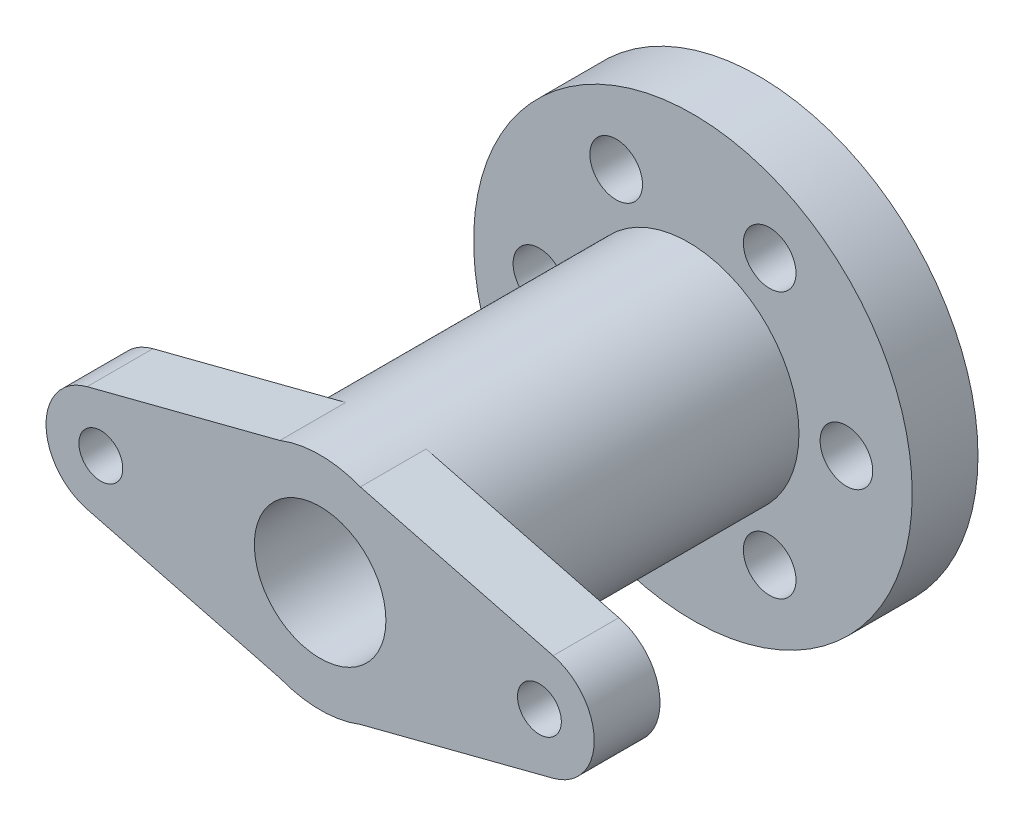
ISO-10303-21;
HEADER;
FILE_DESCRIPTION(('STEP AP214'),'2;1');
FILE_NAME('part.step','',(''),(''),'','','');
FILE_SCHEMA(('AUTOMOTIVE_DESIGN { 1 0 10303 214 1 1 1 1 }'));
ENDSEC;
DATA;
#1=APPLICATION_CONTEXT('core data for automotive mechanical design processes');
#2=APPLICATION_PROTOCOL_DEFINITION('international standard','automotive_design',2000,#1);
#3=PRODUCT_CONTEXT('',#1,'mechanical');
#4=PRODUCT('Part','Part','',(#3));
#5=PRODUCT_RELATED_PRODUCT_CATEGORY('part','',(#4));
#6=PRODUCT_DEFINITION_FORMATION('','',#4);
#7=PRODUCT_DEFINITION_CONTEXT('part definition',#1,'design');
#8=PRODUCT_DEFINITION('design','',#6,#7);
#9=PRODUCT_DEFINITION_SHAPE('','',#8);
#10=(LENGTH_UNIT() NAMED_UNIT(*) SI_UNIT(.MILLI.,.METRE.));
#11=(NAMED_UNIT(*) PLANE_ANGLE_UNIT() SI_UNIT($,.RADIAN.));
#12=(NAMED_UNIT(*) SI_UNIT($,.STERADIAN.) SOLID_ANGLE_UNIT());
#13=UNCERTAINTY_MEASURE_WITH_UNIT(LENGTH_MEASURE(1.E-05),#10,'distance_accuracy_value','');
#14=(GEOMETRIC_REPRESENTATION_CONTEXT(3) GLOBAL_UNCERTAINTY_ASSIGNED_CONTEXT((#13)) GLOBAL_UNIT_ASSIGNED_CONTEXT((#10,
#11,#12)) REPRESENTATION_CONTEXT('',''));
#15=CARTESIAN_POINT('',(0.,0.,0.));
#16=DIRECTION('',(0.,0.,1.));
#17=DIRECTION('',(1.,0.,0.));
#18=AXIS2_PLACEMENT_3D('',#15,#16,#17);
#19=CARTESIAN_POINT('',(0.,0.,16.));
#20=DIRECTION('',(0.,0.,1.));
#21=DIRECTION('',(1.,0.,0.));
#22=AXIS2_PLACEMENT_3D('',#19,#20,#21);
#23=CYLINDRICAL_SURFACE('',#22,25.1818936432499);
#24=CARTESIAN_POINT('',(0.,0.,16.));
#25=DIRECTION('',(0.,0.,1.));
#26=DIRECTION('',(1.,0.,0.));
#27=AXIS2_PLACEMENT_3D('',#24,#25,#26);
#28=CIRCLE('',#27,25.1818936432499);
#29=CARTESIAN_POINT('',(25.1818936432499,0.,16.));
#30=VERTEX_POINT('',#29);
#31=EDGE_CURVE('E243',#30,#30,#28,.T.);
#32=ORIENTED_EDGE('',*,*,#31,.T.);
#33=EDGE_LOOP('',(#32));
#34=FACE_BOUND('',#33,.T.);
#35=CARTESIAN_POINT('',(0.,0.,85.));
#36=DIRECTION('',(0.,0.,1.));
#37=DIRECTION('',(1.,0.,0.));
#38=AXIS2_PLACEMENT_3D('',#35,#36,#37);
#39=CIRCLE('',#38,25.1818936432499);
#40=CARTESIAN_POINT('',(9.17528323307377,23.4508410308207,85.));
#41=VERTEX_POINT('',#40);
#42=CARTESIAN_POINT('',(9.17528323307378,-23.4508410308207,85.));
#43=VERTEX_POINT('',#42);
#44=EDGE_CURVE('E246',#41,#43,#39,.F.);
#45=ORIENTED_EDGE('',*,*,#44,.T.);
#46=DIRECTION('',(0.,0.,1.));
#47=VECTOR('',#46,1.);
#48=CARTESIAN_POINT('',(9.17528323307378,-23.4508410308207,16.));
#49=LINE('',#48,#47);
#50=CARTESIAN_POINT('',(9.17528323307381,-23.4508410308207,100.));
#51=VERTEX_POINT('',#50);
#52=EDGE_CURVE('E197',#43,#51,#49,.T.);
#53=ORIENTED_EDGE('',*,*,#52,.T.);
#54=CARTESIAN_POINT('',(0.,0.,100.));
#55=DIRECTION('',(0.,0.,1.));
#56=DIRECTION('',(1.,0.,0.));
#57=AXIS2_PLACEMENT_3D('',#54,#55,#56);
#58=CIRCLE('',#57,25.1818936432499);
#59=CARTESIAN_POINT('',(-9.1752832330737,-23.4508410308208,100.));
#60=VERTEX_POINT('',#59);
#61=EDGE_CURVE('E127',#60,#51,#58,.T.);
#62=ORIENTED_EDGE('',*,*,#61,.F.);
#63=DIRECTION('',(0.,0.,1.));
#64=VECTOR('',#63,1.);
#65=CARTESIAN_POINT('',(-9.17528323307373,-23.4508410308207,16.));
#66=LINE('',#65,#64);
#67=CARTESIAN_POINT('',(-9.17528323307372,-23.4508410308207,85.));
#68=VERTEX_POINT('',#67);
#69=EDGE_CURVE('E238',#60,#68,#66,.F.);
#70=ORIENTED_EDGE('',*,*,#69,.T.);
#71=CARTESIAN_POINT('',(-9.17528323307363,23.4508410308208,85.));
#72=VERTEX_POINT('',#71);
#73=EDGE_CURVE('E194',#68,#72,#39,.F.);
#74=ORIENTED_EDGE('',*,*,#73,.T.);
#75=DIRECTION('',(0.,0.,1.));
#76=VECTOR('',#75,1.);
#77=CARTESIAN_POINT('',(-9.17528323307364,23.4508410308208,16.));
#78=LINE('',#77,#76);
#79=CARTESIAN_POINT('',(-9.17528323307373,23.4508410308207,100.));
#80=VERTEX_POINT('',#79);
#81=EDGE_CURVE('E187',#72,#80,#78,.T.);
#82=ORIENTED_EDGE('',*,*,#81,.T.);
#83=CARTESIAN_POINT('',(9.17528323307377,23.4508410308207,100.));
#84=VERTEX_POINT('',#83);
#85=EDGE_CURVE('E179',#84,#80,#58,.T.);
#86=ORIENTED_EDGE('',*,*,#85,.F.);
#87=DIRECTION('',(0.,0.,1.));
#88=VECTOR('',#87,1.);
#89=CARTESIAN_POINT('',(9.17528323307377,23.4508410308207,16.));
#90=LINE('',#89,#88);
#91=EDGE_CURVE('E180',#84,#41,#90,.F.);
#92=ORIENTED_EDGE('',*,*,#91,.T.);
#93=EDGE_LOOP('',(#45,#53,#62,#70,#74,#82,#86,#92));
#94=FACE_BOUND('',#93,.T.);
#95=ADVANCED_FACE('F55',(#34,#94),#23,.T.);
#96=CARTESIAN_POINT('',(0.,0.,16.));
#97=DIRECTION('',(0.,0.,1.));
#98=DIRECTION('',(1.,0.,0.));
#99=AXIS2_PLACEMENT_3D('',#96,#97,#98);
#100=PLANE('',#99);
#101=CARTESIAN_POINT('',(0.,0.,16.));
#102=DIRECTION('',(0.,0.,1.));
#103=DIRECTION('',(1.,0.,0.));
#104=AXIS2_PLACEMENT_3D('',#101,#102,#103);
#105=CIRCLE('',#104,15.);
#106=CARTESIAN_POINT('',(15.,0.,16.));
#107=VERTEX_POINT('',#106);
#108=EDGE_CURVE('E176',#107,#107,#105,.T.);
#109=ORIENTED_EDGE('',*,*,#108,.T.);
#110=EDGE_LOOP('',(#109));
#111=FACE_BOUND('',#110,.T.);
#112=ORIENTED_EDGE('',*,*,#31,.F.);
#113=EDGE_LOOP('',(#112));
#114=FACE_BOUND('',#113,.T.);
#115=ADVANCED_FACE('F271',(#111,#114),#100,.F.);
#116=CARTESIAN_POINT('',(0.,0.,100.));
#117=DIRECTION('',(0.,0.,1.));
#118=DIRECTION('',(1.,0.,0.));
#119=AXIS2_PLACEMENT_3D('',#116,#117,#118);
#120=PLANE('',#119);
#121=CARTESIAN_POINT('',(0.,0.,100.));
#122=DIRECTION('',(0.,0.,1.));
#123=DIRECTION('',(1.,0.,0.));
#124=AXIS2_PLACEMENT_3D('',#121,#122,#123);
#125=CIRCLE('',#124,15.);
#126=CARTESIAN_POINT('',(15.,0.,100.));
#127=VERTEX_POINT('',#126);
#128=EDGE_CURVE('E12',#127,#127,#125,.T.);
#129=ORIENTED_EDGE('',*,*,#128,.F.);
#130=EDGE_LOOP('',(#129));
#131=FACE_BOUND('',#130,.T.);
#132=ORIENTED_EDGE('',*,*,#85,.T.);
#133=DIRECTION('',(-0.968245836551854,-0.25,0.));
#134=VECTOR('',#133,1.);
#135=CARTESIAN_POINT('',(-53.125,12.1030729568982,100.));
#136=LINE('',#135,#134);
#137=CARTESIAN_POINT('',(-53.125,12.1030729568982,100.));
#138=VERTEX_POINT('',#137);
#139=EDGE_CURVE('E160',#80,#138,#136,.T.);
#140=ORIENTED_EDGE('',*,*,#139,.T.);
#141=CARTESIAN_POINT('',(-50.,0.,100.));
#142=DIRECTION('',(0.,0.,1.));
#143=DIRECTION('',(1.,0.,0.));
#144=AXIS2_PLACEMENT_3D('',#141,#142,#143);
#145=CIRCLE('',#144,12.5);
#146=CARTESIAN_POINT('',(-53.125,-12.1030729568982,100.));
#147=VERTEX_POINT('',#146);
#148=EDGE_CURVE('E156',#138,#147,#145,.T.);
#149=ORIENTED_EDGE('',*,*,#148,.T.);
#150=DIRECTION('',(0.968245836551854,-0.25,0.));
#151=VECTOR('',#150,1.);
#152=CARTESIAN_POINT('',(-53.125,-12.1030729568982,100.));
#153=LINE('',#152,#151);
#154=EDGE_CURVE('E153',#147,#60,#153,.T.);
#155=ORIENTED_EDGE('',*,*,#154,.T.);
#156=ORIENTED_EDGE('',*,*,#61,.T.);
#157=DIRECTION('',(0.968245836551854,0.25,0.));
#158=VECTOR('',#157,1.);
#159=CARTESIAN_POINT('',(6.24999999999997,-24.2061459137964,100.));
#160=LINE('',#159,#158);
#161=CARTESIAN_POINT('',(53.125,-12.1030729568982,100.));
#162=VERTEX_POINT('',#161);
#163=EDGE_CURVE('E116',#51,#162,#160,.T.);
#164=ORIENTED_EDGE('',*,*,#163,.T.);
#165=CARTESIAN_POINT('',(50.,0.,100.));
#166=DIRECTION('',(0.,0.,1.));
#167=DIRECTION('',(1.,0.,0.));
#168=AXIS2_PLACEMENT_3D('',#165,#166,#167);
#169=CIRCLE('',#168,12.5);
#170=CARTESIAN_POINT('',(53.125,12.1030729568982,100.));
#171=VERTEX_POINT('',#170);
#172=EDGE_CURVE('E123',#162,#171,#169,.T.);
#173=ORIENTED_EDGE('',*,*,#172,.T.);
#174=DIRECTION('',(-0.968245836551854,0.25,0.));
#175=VECTOR('',#174,1.);
#176=CARTESIAN_POINT('',(6.24999999999997,24.2061459137964,100.));
#177=LINE('',#176,#175);
#178=EDGE_CURVE('E146',#171,#84,#177,.T.);
#179=ORIENTED_EDGE('',*,*,#178,.T.);
#180=EDGE_LOOP('',(#132,#140,#149,#155,#156,#164,#173,#179));
#181=FACE_BOUND('',#180,.T.);
#182=CARTESIAN_POINT('',(50.,0.,100.));
#183=DIRECTION('',(0.,0.,1.));
#184=DIRECTION('',(1.,0.,0.));
#185=AXIS2_PLACEMENT_3D('',#182,#183,#184);
#186=CIRCLE('',#185,5.);
#187=CARTESIAN_POINT('',(55.,0.,100.));
#188=VERTEX_POINT('',#187);
#189=EDGE_CURVE('E65',#188,#188,#186,.T.);
#190=ORIENTED_EDGE('',*,*,#189,.F.);
#191=EDGE_LOOP('',(#190));
#192=FACE_BOUND('',#191,.T.);
#193=CARTESIAN_POINT('',(-50.,0.,100.));
#194=DIRECTION('',(0.,0.,1.));
#195=DIRECTION('',(1.,0.,0.));
#196=AXIS2_PLACEMENT_3D('',#193,#194,#195);
#197=CIRCLE('',#196,5.);
#198=CARTESIAN_POINT('',(-45.,0.,100.));
#199=VERTEX_POINT('',#198);
#200=EDGE_CURVE('E149',#199,#199,#197,.T.);
#201=ORIENTED_EDGE('',*,*,#200,.F.);
#202=EDGE_LOOP('',(#201));
#203=FACE_BOUND('',#202,.T.);
#204=ADVANCED_FACE('F119',(#131,#181,#192,#203),#120,.T.);
#205=CARTESIAN_POINT('',(-50.,0.,100.));
#206=DIRECTION('',(0.,0.,-1.));
#207=DIRECTION('',(-1.,0.,0.));
#208=AXIS2_PLACEMENT_3D('',#205,#206,#207);
#209=CYLINDRICAL_SURFACE('',#208,5.);
#210=ORIENTED_EDGE('',*,*,#200,.T.);
#211=EDGE_LOOP('',(#210));
#212=FACE_BOUND('',#211,.T.);
#213=CARTESIAN_POINT('',(-50.,0.,85.));
#214=DIRECTION('',(0.,0.,1.));
#215=DIRECTION('',(1.,0.,0.));
#216=AXIS2_PLACEMENT_3D('',#213,#214,#215);
#217=CIRCLE('',#216,5.);
#218=CARTESIAN_POINT('',(-45.,0.,85.));
#219=VERTEX_POINT('',#218);
#220=EDGE_CURVE('E161',#219,#219,#217,.T.);
#221=ORIENTED_EDGE('',*,*,#220,.F.);
#222=EDGE_LOOP('',(#221));
#223=FACE_BOUND('',#222,.T.);
#224=ADVANCED_FACE('F262',(#212,#223),#209,.F.);
#225=CARTESIAN_POINT('',(-53.125,12.1030729568982,100.));
#226=DIRECTION('',(0.25,-0.968245836551854,0.));
#227=DIRECTION('',(0.968245836551854,0.25,0.));
#228=AXIS2_PLACEMENT_3D('',#225,#226,#227);
#229=PLANE('',#228);
#230=ORIENTED_EDGE('',*,*,#81,.F.);
#231=DIRECTION('',(-0.968245836551854,-0.25,0.));
#232=VECTOR('',#231,1.);
#233=CARTESIAN_POINT('',(-53.125,12.1030729568982,85.));
#234=LINE('',#233,#232);
#235=CARTESIAN_POINT('',(-53.125,12.1030729568982,85.));
#236=VERTEX_POINT('',#235);
#237=EDGE_CURVE('E170',#72,#236,#234,.T.);
#238=ORIENTED_EDGE('',*,*,#237,.T.);
#239=DIRECTION('',(0.,0.,-1.));
#240=VECTOR('',#239,1.);
#241=CARTESIAN_POINT('',(-53.125,12.1030729568982,100.));
#242=LINE('',#241,#240);
#243=EDGE_CURVE('E166',#138,#236,#242,.T.);
#244=ORIENTED_EDGE('',*,*,#243,.F.);
#245=ORIENTED_EDGE('',*,*,#139,.F.);
#246=EDGE_LOOP('',(#230,#238,#244,#245));
#247=FACE_BOUND('',#246,.T.);
#248=ADVANCED_FACE('F229',(#247),#229,.F.);
#249=CARTESIAN_POINT('',(-53.125,-12.1030729568982,100.));
#250=DIRECTION('',(0.25,0.968245836551854,0.));
#251=DIRECTION('',(-0.968245836551854,0.25,0.));
#252=AXIS2_PLACEMENT_3D('',#249,#250,#251);
#253=PLANE('',#252);
#254=ORIENTED_EDGE('',*,*,#69,.F.);
#255=ORIENTED_EDGE('',*,*,#154,.F.);
#256=DIRECTION('',(0.,0.,-1.));
#257=VECTOR('',#256,1.);
#258=CARTESIAN_POINT('',(-53.125,-12.1030729568982,100.));
#259=LINE('',#258,#257);
#260=CARTESIAN_POINT('',(-53.125,-12.1030729568982,85.));
#261=VERTEX_POINT('',#260);
#262=EDGE_CURVE('E200',#147,#261,#259,.T.);
#263=ORIENTED_EDGE('',*,*,#262,.T.);
#264=DIRECTION('',(0.968245836551854,-0.25,0.));
#265=VECTOR('',#264,1.);
#266=CARTESIAN_POINT('',(-53.125,-12.1030729568982,85.));
#267=LINE('',#266,#265);
#268=EDGE_CURVE('E203',#261,#68,#267,.T.);
#269=ORIENTED_EDGE('',*,*,#268,.T.);
#270=EDGE_LOOP('',(#254,#255,#263,#269));
#271=FACE_BOUND('',#270,.T.);
#272=ADVANCED_FACE('F236',(#271),#253,.F.);
#273=CARTESIAN_POINT('',(-50.,0.,100.));
#274=DIRECTION('',(0.,0.,-1.));
#275=DIRECTION('',(-1.,0.,0.));
#276=AXIS2_PLACEMENT_3D('',#273,#274,#275);
#277=CYLINDRICAL_SURFACE('',#276,12.5);
#278=CARTESIAN_POINT('',(-50.,0.,85.));
#279=DIRECTION('',(0.,0.,1.));
#280=DIRECTION('',(1.,0.,0.));
#281=AXIS2_PLACEMENT_3D('',#278,#279,#280);
#282=CIRCLE('',#281,12.5);
#283=EDGE_CURVE('E210',#236,#261,#282,.T.);
#284=ORIENTED_EDGE('',*,*,#283,.T.);
#285=ORIENTED_EDGE('',*,*,#262,.F.);
#286=ORIENTED_EDGE('',*,*,#148,.F.);
#287=ORIENTED_EDGE('',*,*,#243,.T.);
#288=EDGE_LOOP('',(#284,#285,#286,#287));
#289=FACE_BOUND('',#288,.T.);
#290=ADVANCED_FACE('F233',(#289),#277,.T.);
#291=CARTESIAN_POINT('',(-50.,0.,85.));
#292=DIRECTION('',(0.,0.,1.));
#293=DIRECTION('',(1.,0.,0.));
#294=AXIS2_PLACEMENT_3D('',#291,#292,#293);
#295=PLANE('',#294);
#296=ORIENTED_EDGE('',*,*,#73,.F.);
#297=ORIENTED_EDGE('',*,*,#268,.F.);
#298=ORIENTED_EDGE('',*,*,#283,.F.);
#299=ORIENTED_EDGE('',*,*,#237,.F.);
#300=EDGE_LOOP('',(#296,#297,#298,#299));
#301=FACE_BOUND('',#300,.T.);
#302=ORIENTED_EDGE('',*,*,#220,.T.);
#303=EDGE_LOOP('',(#302));
#304=FACE_BOUND('',#303,.T.);
#305=ADVANCED_FACE('F256',(#301,#304),#295,.F.);
#306=ORIENTED_EDGE('',*,*,#44,.F.);
#307=DIRECTION('',(-0.968245836551854,0.25,0.));
#308=VECTOR('',#307,1.);
#309=CARTESIAN_POINT('',(6.24999999999997,24.2061459137964,85.));
#310=LINE('',#309,#308);
#311=CARTESIAN_POINT('',(53.125,12.1030729568982,85.));
#312=VERTEX_POINT('',#311);
#313=EDGE_CURVE('E73',#312,#41,#310,.T.);
#314=ORIENTED_EDGE('',*,*,#313,.F.);
#315=CARTESIAN_POINT('',(50.,0.,85.));
#316=DIRECTION('',(0.,0.,1.));
#317=DIRECTION('',(1.,0.,0.));
#318=AXIS2_PLACEMENT_3D('',#315,#316,#317);
#319=CIRCLE('',#318,12.5);
#320=CARTESIAN_POINT('',(53.125,-12.1030729568982,85.));
#321=VERTEX_POINT('',#320);
#322=EDGE_CURVE('E141',#321,#312,#319,.T.);
#323=ORIENTED_EDGE('',*,*,#322,.F.);
#324=DIRECTION('',(0.968245836551854,0.25,0.));
#325=VECTOR('',#324,1.);
#326=CARTESIAN_POINT('',(6.24999999999997,-24.2061459137964,85.));
#327=LINE('',#326,#325);
#328=EDGE_CURVE('E136',#43,#321,#327,.T.);
#329=ORIENTED_EDGE('',*,*,#328,.F.);
#330=EDGE_LOOP('',(#306,#314,#323,#329));
#331=FACE_BOUND('',#330,.T.);
#332=CARTESIAN_POINT('',(50.,0.,85.));
#333=DIRECTION('',(0.,0.,1.));
#334=DIRECTION('',(1.,0.,0.));
#335=AXIS2_PLACEMENT_3D('',#332,#333,#334);
#336=CIRCLE('',#335,5.);
#337=CARTESIAN_POINT('',(55.,0.,85.));
#338=VERTEX_POINT('',#337);
#339=EDGE_CURVE('E165',#338,#338,#336,.T.);
#340=ORIENTED_EDGE('',*,*,#339,.T.);
#341=EDGE_LOOP('',(#340));
#342=FACE_BOUND('',#341,.T.);
#343=ADVANCED_FACE('F252',(#331,#342),#295,.F.);
#344=CARTESIAN_POINT('',(6.24999999999997,-24.2061459137964,100.));
#345=DIRECTION('',(-0.25,0.968245836551854,0.));
#346=DIRECTION('',(-0.968245836551854,-0.25,0.));
#347=AXIS2_PLACEMENT_3D('',#344,#345,#346);
#348=PLANE('',#347);
#349=ORIENTED_EDGE('',*,*,#52,.F.);
#350=ORIENTED_EDGE('',*,*,#328,.T.);
#351=DIRECTION('',(0.,0.,-1.));
#352=VECTOR('',#351,1.);
#353=CARTESIAN_POINT('',(53.125,-12.1030729568982,100.));
#354=LINE('',#353,#352);
#355=EDGE_CURVE('E133',#162,#321,#354,.T.);
#356=ORIENTED_EDGE('',*,*,#355,.F.);
#357=ORIENTED_EDGE('',*,*,#163,.F.);
#358=EDGE_LOOP('',(#349,#350,#356,#357));
#359=FACE_BOUND('',#358,.T.);
#360=ADVANCED_FACE('F134',(#359),#348,.F.);
#361=CARTESIAN_POINT('',(50.,0.,100.));
#362=DIRECTION('',(0.,0.,-1.));
#363=DIRECTION('',(-1.,0.,0.));
#364=AXIS2_PLACEMENT_3D('',#361,#362,#363);
#365=CYLINDRICAL_SURFACE('',#364,12.5);
#366=ORIENTED_EDGE('',*,*,#322,.T.);
#367=DIRECTION('',(0.,0.,-1.));
#368=VECTOR('',#367,1.);
#369=CARTESIAN_POINT('',(53.125,12.1030729568982,100.));
#370=LINE('',#369,#368);
#371=EDGE_CURVE('E140',#171,#312,#370,.T.);
#372=ORIENTED_EDGE('',*,*,#371,.F.);
#373=ORIENTED_EDGE('',*,*,#172,.F.);
#374=ORIENTED_EDGE('',*,*,#355,.T.);
#375=EDGE_LOOP('',(#366,#372,#373,#374));
#376=FACE_BOUND('',#375,.T.);
#377=ADVANCED_FACE('F143',(#376),#365,.T.);
#378=CARTESIAN_POINT('',(6.24999999999997,24.2061459137964,100.));
#379=DIRECTION('',(-0.25,-0.968245836551854,0.));
#380=DIRECTION('',(0.968245836551854,-0.25,0.));
#381=AXIS2_PLACEMENT_3D('',#378,#379,#380);
#382=PLANE('',#381);
#383=ORIENTED_EDGE('',*,*,#91,.F.);
#384=ORIENTED_EDGE('',*,*,#178,.F.);
#385=ORIENTED_EDGE('',*,*,#371,.T.);
#386=ORIENTED_EDGE('',*,*,#313,.T.);
#387=EDGE_LOOP('',(#383,#384,#385,#386));
#388=FACE_BOUND('',#387,.T.);
#389=ADVANCED_FACE('F254',(#388),#382,.F.);
#390=CARTESIAN_POINT('',(50.,0.,100.));
#391=DIRECTION('',(0.,0.,-1.));
#392=DIRECTION('',(-1.,0.,0.));
#393=AXIS2_PLACEMENT_3D('',#390,#391,#392);
#394=CYLINDRICAL_SURFACE('',#393,5.);
#395=ORIENTED_EDGE('',*,*,#189,.T.);
#396=EDGE_LOOP('',(#395));
#397=FACE_BOUND('',#396,.T.);
#398=ORIENTED_EDGE('',*,*,#339,.F.);
#399=EDGE_LOOP('',(#398));
#400=FACE_BOUND('',#399,.T.);
#401=ADVANCED_FACE('F291',(#397,#400),#394,.F.);
#402=CARTESIAN_POINT('',(0.,0.,-20.));
#403=DIRECTION('',(0.,0.,1.));
#404=DIRECTION('',(1.,0.,0.));
#405=AXIS2_PLACEMENT_3D('',#402,#403,#404);
#406=CYLINDRICAL_SURFACE('',#405,15.);
#407=ORIENTED_EDGE('',*,*,#128,.T.);
#408=EDGE_LOOP('',(#407));
#409=FACE_BOUND('',#408,.T.);
#410=ORIENTED_EDGE('',*,*,#108,.F.);
#411=EDGE_LOOP('',(#410));
#412=FACE_BOUND('',#411,.T.);
#413=ADVANCED_FACE('F57',(#409,#412),#406,.F.);
#414=CLOSED_SHELL('',(#95,#115,#204,#224,#248,#272,#290,#305,#343,#360,#377,#389,#401,#413));
#415=MANIFOLD_SOLID_BREP('B2',#414);
#416=CARTESIAN_POINT('',(0.,0.,15.));
#417=DIRECTION('',(0.,0.,-1.));
#418=DIRECTION('',(-1.,0.,0.));
#419=AXIS2_PLACEMENT_3D('',#416,#417,#418);
#420=CYLINDRICAL_SURFACE('',#419,50.);
#421=CARTESIAN_POINT('',(0.,0.,15.));
#422=DIRECTION('',(0.,0.,1.));
#423=DIRECTION('',(1.,0.,0.));
#424=AXIS2_PLACEMENT_3D('',#421,#422,#423);
#425=CIRCLE('',#424,50.);
#426=CARTESIAN_POINT('',(50.,0.,15.));
#427=VERTEX_POINT('',#426);
#428=EDGE_CURVE('E54',#427,#427,#425,.T.);
#429=ORIENTED_EDGE('',*,*,#428,.F.);
#430=EDGE_LOOP('',(#429));
#431=FACE_BOUND('',#430,.T.);
#432=CARTESIAN_POINT('',(0.,0.,0.));
#433=DIRECTION('',(0.,0.,1.));
#434=DIRECTION('',(1.,0.,0.));
#435=AXIS2_PLACEMENT_3D('',#432,#433,#434);
#436=CIRCLE('',#435,50.);
#437=CARTESIAN_POINT('',(50.,0.,0.));
#438=VERTEX_POINT('',#437);
#439=EDGE_CURVE('E424',#438,#438,#436,.T.);
#440=ORIENTED_EDGE('',*,*,#439,.T.);
#441=EDGE_LOOP('',(#440));
#442=FACE_BOUND('',#441,.T.);
#443=ADVANCED_FACE('F420',(#431,#442),#420,.T.);
#444=CARTESIAN_POINT('',(17.4999999999997,-30.3108891324555,15.));
#445=DIRECTION('',(0.,0.,-1.));
#446=DIRECTION('',(-1.,0.,0.));
#447=AXIS2_PLACEMENT_3D('',#444,#445,#446);
#448=CYLINDRICAL_SURFACE('',#447,6.);
#449=CARTESIAN_POINT('',(17.4999999999997,-30.3108891324555,15.));
#450=DIRECTION('',(0.,0.,1.));
#451=DIRECTION('',(1.,0.,0.));
#452=AXIS2_PLACEMENT_3D('',#449,#450,#451);
#453=CIRCLE('',#452,6.);
#454=CARTESIAN_POINT('',(23.4999999999997,-30.3108891324555,15.));
#455=VERTEX_POINT('',#454);
#456=EDGE_CURVE('E428',#455,#455,#453,.T.);
#457=ORIENTED_EDGE('',*,*,#456,.T.);
#458=EDGE_LOOP('',(#457));
#459=FACE_BOUND('',#458,.T.);
#460=CARTESIAN_POINT('',(17.4999999999997,-30.3108891324555,0.));
#461=DIRECTION('',(0.,0.,1.));
#462=DIRECTION('',(1.,0.,0.));
#463=AXIS2_PLACEMENT_3D('',#460,#461,#462);
#464=CIRCLE('',#463,6.);
#465=CARTESIAN_POINT('',(23.4999999999997,-30.3108891324555,0.));
#466=VERTEX_POINT('',#465);
#467=EDGE_CURVE('E452',#466,#466,#464,.T.);
#468=ORIENTED_EDGE('',*,*,#467,.F.);
#469=EDGE_LOOP('',(#468));
#470=FACE_BOUND('',#469,.T.);
#471=ADVANCED_FACE('F507',(#459,#470),#448,.F.);
#472=CARTESIAN_POINT('',(35.,-2.44403693719019E-13,15.));
#473=DIRECTION('',(0.,0.,-1.));
#474=DIRECTION('',(-1.,0.,0.));
#475=AXIS2_PLACEMENT_3D('',#472,#473,#474);
#476=CYLINDRICAL_SURFACE('',#475,6.);
#477=CARTESIAN_POINT('',(35.,-2.44403693719019E-13,15.));
#478=DIRECTION('',(0.,0.,1.));
#479=DIRECTION('',(1.,0.,0.));
#480=AXIS2_PLACEMENT_3D('',#477,#478,#479);
#481=CIRCLE('',#480,6.);
#482=CARTESIAN_POINT('',(41.,-2.44403693719019E-13,15.));
#483=VERTEX_POINT('',#482);
#484=EDGE_CURVE('E433',#483,#483,#481,.T.);
#485=ORIENTED_EDGE('',*,*,#484,.T.);
#486=EDGE_LOOP('',(#485));
#487=FACE_BOUND('',#486,.T.);
#488=CARTESIAN_POINT('',(35.,-2.44403693719019E-13,0.));
#489=DIRECTION('',(0.,0.,1.));
#490=DIRECTION('',(1.,0.,0.));
#491=AXIS2_PLACEMENT_3D('',#488,#489,#490);
#492=CIRCLE('',#491,6.);
#493=CARTESIAN_POINT('',(41.,-2.44403693719019E-13,0.));
#494=VERTEX_POINT('',#493);
#495=EDGE_CURVE('E450',#494,#494,#492,.T.);
#496=ORIENTED_EDGE('',*,*,#495,.F.);
#497=EDGE_LOOP('',(#496));
#498=FACE_BOUND('',#497,.T.);
#499=ADVANCED_FACE('F478',(#487,#498),#476,.F.);
#500=CARTESIAN_POINT('',(17.5000000000001,30.3108891324553,15.));
#501=DIRECTION('',(0.,0.,-1.));
#502=DIRECTION('',(-1.,0.,0.));
#503=AXIS2_PLACEMENT_3D('',#500,#501,#502);
#504=CYLINDRICAL_SURFACE('',#503,6.);
#505=CARTESIAN_POINT('',(17.5000000000001,30.3108891324553,15.));
#506=DIRECTION('',(0.,0.,1.));
#507=DIRECTION('',(1.,0.,0.));
#508=AXIS2_PLACEMENT_3D('',#505,#506,#507);
#509=CIRCLE('',#508,6.);
#510=CARTESIAN_POINT('',(23.5000000000001,30.3108891324553,15.));
#511=VERTEX_POINT('',#510);
#512=EDGE_CURVE('E473',#511,#511,#509,.T.);
#513=ORIENTED_EDGE('',*,*,#512,.T.);
#514=EDGE_LOOP('',(#513));
#515=FACE_BOUND('',#514,.T.);
#516=CARTESIAN_POINT('',(17.5000000000001,30.3108891324553,0.));
#517=DIRECTION('',(0.,0.,1.));
#518=DIRECTION('',(1.,0.,0.));
#519=AXIS2_PLACEMENT_3D('',#516,#517,#518);
#520=CIRCLE('',#519,6.);
#521=CARTESIAN_POINT('',(23.5000000000001,30.3108891324553,0.));
#522=VERTEX_POINT('',#521);
#523=EDGE_CURVE('E447',#522,#522,#520,.T.);
#524=ORIENTED_EDGE('',*,*,#523,.F.);
#525=EDGE_LOOP('',(#524));
#526=FACE_BOUND('',#525,.T.);
#527=ADVANCED_FACE('F518',(#515,#526),#504,.F.);
#528=CARTESIAN_POINT('',(-17.4999999999999,30.3108891324554,15.));
#529=DIRECTION('',(0.,0.,-1.));
#530=DIRECTION('',(-1.,0.,0.));
#531=AXIS2_PLACEMENT_3D('',#528,#529,#530);
#532=CYLINDRICAL_SURFACE('',#531,6.);
#533=CARTESIAN_POINT('',(-17.4999999999999,30.3108891324554,15.));
#534=DIRECTION('',(0.,0.,1.));
#535=DIRECTION('',(1.,0.,0.));
#536=AXIS2_PLACEMENT_3D('',#533,#534,#535);
#537=CIRCLE('',#536,6.);
#538=CARTESIAN_POINT('',(-11.4999999999999,30.3108891324554,15.));
#539=VERTEX_POINT('',#538);
#540=EDGE_CURVE('E466',#539,#539,#537,.T.);
#541=ORIENTED_EDGE('',*,*,#540,.T.);
#542=EDGE_LOOP('',(#541));
#543=FACE_BOUND('',#542,.T.);
#544=CARTESIAN_POINT('',(-17.4999999999999,30.3108891324554,0.));
#545=DIRECTION('',(0.,0.,1.));
#546=DIRECTION('',(1.,0.,0.));
#547=AXIS2_PLACEMENT_3D('',#544,#545,#546);
#548=CIRCLE('',#547,6.);
#549=CARTESIAN_POINT('',(-11.4999999999999,30.3108891324554,0.));
#550=VERTEX_POINT('',#549);
#551=EDGE_CURVE('E444',#550,#550,#548,.T.);
#552=ORIENTED_EDGE('',*,*,#551,.F.);
#553=EDGE_LOOP('',(#552));
#554=FACE_BOUND('',#553,.T.);
#555=ADVANCED_FACE('F521',(#543,#554),#532,.F.);
#556=CARTESIAN_POINT('',(-35.,0.,15.));
#557=DIRECTION('',(0.,0.,-1.));
#558=DIRECTION('',(-1.,0.,0.));
#559=AXIS2_PLACEMENT_3D('',#556,#557,#558);
#560=CYLINDRICAL_SURFACE('',#559,6.);
#561=CARTESIAN_POINT('',(-35.,0.,15.));
#562=DIRECTION('',(0.,0.,1.));
#563=DIRECTION('',(1.,0.,0.));
#564=AXIS2_PLACEMENT_3D('',#561,#562,#563);
#565=CIRCLE('',#564,6.);
#566=CARTESIAN_POINT('',(-29.,0.,15.));
#567=VERTEX_POINT('',#566);
#568=EDGE_CURVE('E461',#567,#567,#565,.T.);
#569=ORIENTED_EDGE('',*,*,#568,.T.);
#570=EDGE_LOOP('',(#569));
#571=FACE_BOUND('',#570,.T.);
#572=CARTESIAN_POINT('',(-35.,0.,0.));
#573=DIRECTION('',(0.,0.,1.));
#574=DIRECTION('',(1.,0.,0.));
#575=AXIS2_PLACEMENT_3D('',#572,#573,#574);
#576=CIRCLE('',#575,6.);
#577=CARTESIAN_POINT('',(-29.,0.,0.));
#578=VERTEX_POINT('',#577);
#579=EDGE_CURVE('E440',#578,#578,#576,.T.);
#580=ORIENTED_EDGE('',*,*,#579,.F.);
#581=EDGE_LOOP('',(#580));
#582=FACE_BOUND('',#581,.T.);
#583=ADVANCED_FACE('F484',(#571,#582),#560,.F.);
#584=CARTESIAN_POINT('',(0.,0.,15.));
#585=DIRECTION('',(0.,0.,1.));
#586=DIRECTION('',(1.,0.,0.));
#587=AXIS2_PLACEMENT_3D('',#584,#585,#586);
#588=PLANE('',#587);
#589=CARTESIAN_POINT('',(-17.5000000000004,-30.3108891324552,15.));
#590=DIRECTION('',(0.,0.,1.));
#591=DIRECTION('',(1.,0.,0.));
#592=AXIS2_PLACEMENT_3D('',#589,#590,#591);
#593=CIRCLE('',#592,6.);
#594=CARTESIAN_POINT('',(-11.5000000000004,-30.3108891324552,15.));
#595=VERTEX_POINT('',#594);
#596=EDGE_CURVE('E457',#595,#595,#593,.T.);
#597=ORIENTED_EDGE('',*,*,#596,.F.);
#598=EDGE_LOOP('',(#597));
#599=FACE_BOUND('',#598,.T.);
#600=ORIENTED_EDGE('',*,*,#568,.F.);
#601=EDGE_LOOP('',(#600));
#602=FACE_BOUND('',#601,.T.);
#603=ORIENTED_EDGE('',*,*,#540,.F.);
#604=EDGE_LOOP('',(#603));
#605=FACE_BOUND('',#604,.T.);
#606=ORIENTED_EDGE('',*,*,#512,.F.);
#607=EDGE_LOOP('',(#606));
#608=FACE_BOUND('',#607,.T.);
#609=ORIENTED_EDGE('',*,*,#484,.F.);
#610=EDGE_LOOP('',(#609));
#611=FACE_BOUND('',#610,.T.);
#612=ORIENTED_EDGE('',*,*,#456,.F.);
#613=EDGE_LOOP('',(#612));
#614=FACE_BOUND('',#613,.T.);
#615=ORIENTED_EDGE('',*,*,#428,.T.);
#616=EDGE_LOOP('',(#615));
#617=FACE_BOUND('',#616,.T.);
#618=CARTESIAN_POINT('',(0.,0.,15.));
#619=DIRECTION('',(0.,0.,1.));
#620=DIRECTION('',(1.,0.,0.));
#621=AXIS2_PLACEMENT_3D('',#618,#619,#620);
#622=CIRCLE('',#621,15.);
#623=CARTESIAN_POINT('',(15.,0.,15.));
#624=VERTEX_POINT('',#623);
#625=EDGE_CURVE('E441',#624,#624,#622,.T.);
#626=ORIENTED_EDGE('',*,*,#625,.F.);
#627=EDGE_LOOP('',(#626));
#628=FACE_BOUND('',#627,.T.);
#629=ADVANCED_FACE('F481',(#599,#602,#605,#608,#611,#614,#617,#628),#588,.T.);
#630=CARTESIAN_POINT('',(-17.5000000000004,-30.3108891324552,15.));
#631=DIRECTION('',(0.,0.,-1.));
#632=DIRECTION('',(-1.,0.,0.));
#633=AXIS2_PLACEMENT_3D('',#630,#631,#632);
#634=CYLINDRICAL_SURFACE('',#633,6.);
#635=ORIENTED_EDGE('',*,*,#596,.T.);
#636=EDGE_LOOP('',(#635));
#637=FACE_BOUND('',#636,.T.);
#638=CARTESIAN_POINT('',(-17.5000000000004,-30.3108891324552,0.));
#639=DIRECTION('',(0.,0.,1.));
#640=DIRECTION('',(1.,0.,0.));
#641=AXIS2_PLACEMENT_3D('',#638,#639,#640);
#642=CIRCLE('',#641,6.);
#643=CARTESIAN_POINT('',(-11.5000000000004,-30.3108891324552,0.));
#644=VERTEX_POINT('',#643);
#645=EDGE_CURVE('E437',#644,#644,#642,.T.);
#646=ORIENTED_EDGE('',*,*,#645,.F.);
#647=EDGE_LOOP('',(#646));
#648=FACE_BOUND('',#647,.T.);
#649=ADVANCED_FACE('F422',(#637,#648),#634,.F.);
#650=CARTESIAN_POINT('',(0.,0.,0.));
#651=DIRECTION('',(0.,0.,1.));
#652=DIRECTION('',(1.,0.,0.));
#653=AXIS2_PLACEMENT_3D('',#650,#651,#652);
#654=PLANE('',#653);
#655=CARTESIAN_POINT('',(0.,0.,0.));
#656=DIRECTION('',(0.,0.,1.));
#657=DIRECTION('',(1.,0.,0.));
#658=AXIS2_PLACEMENT_3D('',#655,#656,#657);
#659=CIRCLE('',#658,15.);
#660=CARTESIAN_POINT('',(15.,0.,0.));
#661=VERTEX_POINT('',#660);
#662=EDGE_CURVE('E492',#661,#661,#659,.T.);
#663=ORIENTED_EDGE('',*,*,#662,.T.);
#664=EDGE_LOOP('',(#663));
#665=FACE_BOUND('',#664,.T.);
#666=ORIENTED_EDGE('',*,*,#645,.T.);
#667=EDGE_LOOP('',(#666));
#668=FACE_BOUND('',#667,.T.);
#669=ORIENTED_EDGE('',*,*,#579,.T.);
#670=EDGE_LOOP('',(#669));
#671=FACE_BOUND('',#670,.T.);
#672=ORIENTED_EDGE('',*,*,#551,.T.);
#673=EDGE_LOOP('',(#672));
#674=FACE_BOUND('',#673,.T.);
#675=ORIENTED_EDGE('',*,*,#523,.T.);
#676=EDGE_LOOP('',(#675));
#677=FACE_BOUND('',#676,.T.);
#678=ORIENTED_EDGE('',*,*,#495,.T.);
#679=EDGE_LOOP('',(#678));
#680=FACE_BOUND('',#679,.T.);
#681=ORIENTED_EDGE('',*,*,#467,.T.);
#682=EDGE_LOOP('',(#681));
#683=FACE_BOUND('',#682,.T.);
#684=ORIENTED_EDGE('',*,*,#439,.F.);
#685=EDGE_LOOP('',(#684));
#686=FACE_BOUND('',#685,.T.);
#687=ADVANCED_FACE('F496',(#665,#668,#671,#674,#677,#680,#683,#686),#654,.F.);
#688=CARTESIAN_POINT('',(0.,0.,-20.));
#689=DIRECTION('',(0.,0.,1.));
#690=DIRECTION('',(1.,0.,0.));
#691=AXIS2_PLACEMENT_3D('',#688,#689,#690);
#692=CYLINDRICAL_SURFACE('',#691,15.);
#693=ORIENTED_EDGE('',*,*,#625,.T.);
#694=EDGE_LOOP('',(#693));
#695=FACE_BOUND('',#694,.T.);
#696=ORIENTED_EDGE('',*,*,#662,.F.);
#697=EDGE_LOOP('',(#696));
#698=FACE_BOUND('',#697,.T.);
#699=ADVANCED_FACE('F499',(#695,#698),#692,.F.);
#700=CLOSED_SHELL('',(#443,#471,#499,#527,#555,#583,#629,#649,#687,#699));
#701=MANIFOLD_SOLID_BREP('B6',#700);
#702=ADVANCED_BREP_SHAPE_REPRESENTATION('',(#18,#415,#701),#14);
#703=SHAPE_DEFINITION_REPRESENTATION(#9,#702);
ENDSEC;
END-ISO-10303-21;
